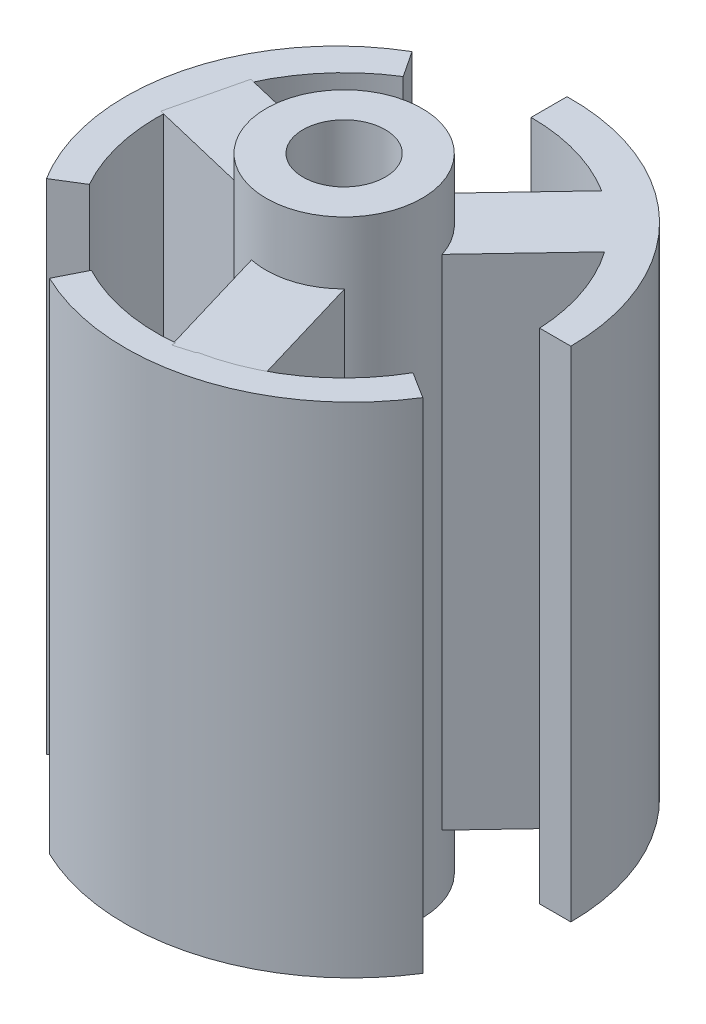
ISO-10303-21;
HEADER;
FILE_DESCRIPTION(('STEP AP214'),'2;1');
FILE_NAME('part.step','',(''),(''),'','','');
FILE_SCHEMA(('AUTOMOTIVE_DESIGN { 1 0 10303 214 1 1 1 1 }'));
ENDSEC;
DATA;
#1=APPLICATION_CONTEXT('core data for automotive mechanical design processes');
#2=APPLICATION_PROTOCOL_DEFINITION('international standard','automotive_design',2000,#1);
#3=PRODUCT_CONTEXT('',#1,'mechanical');
#4=PRODUCT('Part','Part','',(#3));
#5=PRODUCT_RELATED_PRODUCT_CATEGORY('part','',(#4));
#6=PRODUCT_DEFINITION_FORMATION('','',#4);
#7=PRODUCT_DEFINITION_CONTEXT('part definition',#1,'design');
#8=PRODUCT_DEFINITION('design','',#6,#7);
#9=PRODUCT_DEFINITION_SHAPE('','',#8);
#10=(LENGTH_UNIT() NAMED_UNIT(*) SI_UNIT(.MILLI.,.METRE.));
#11=(NAMED_UNIT(*) PLANE_ANGLE_UNIT() SI_UNIT($,.RADIAN.));
#12=(NAMED_UNIT(*) SI_UNIT($,.STERADIAN.) SOLID_ANGLE_UNIT());
#13=UNCERTAINTY_MEASURE_WITH_UNIT(LENGTH_MEASURE(1.E-05),#10,'distance_accuracy_value','');
#14=(GEOMETRIC_REPRESENTATION_CONTEXT(3) GLOBAL_UNCERTAINTY_ASSIGNED_CONTEXT((#13)) GLOBAL_UNIT_ASSIGNED_CONTEXT((#10,
#11,#12)) REPRESENTATION_CONTEXT('',''));
#15=CARTESIAN_POINT('',(0.,0.,0.));
#16=DIRECTION('',(0.,0.,1.));
#17=DIRECTION('',(1.,0.,0.));
#18=AXIS2_PLACEMENT_3D('',#15,#16,#17);
#19=CARTESIAN_POINT('',(0.,40.,-0.700234787448357));
#20=DIRECTION('',(-0.833300516288587,0.,0.552820268761172));
#21=DIRECTION('',(0.552820268761172,0.,0.833300516288587));
#22=AXIS2_PLACEMENT_3D('',#19,#20,#21);
#23=PLANE('',#22);
#24=DIRECTION('',(0.,-1.,0.));
#25=VECTOR('',#24,1.);
#26=CARTESIAN_POINT('',(-7.96696829436854,40.,-12.7093436571888));
#27=LINE('',#26,#25);
#28=CARTESIAN_POINT('',(-7.96696829436854,0.,-12.7093436571888));
#29=VERTEX_POINT('',#28);
#30=CARTESIAN_POINT('',(-7.96696829436854,40.,-12.7093436571888));
#31=VERTEX_POINT('',#30);
#32=EDGE_CURVE('E172',#29,#31,#27,.F.);
#33=ORIENTED_EDGE('',*,*,#32,.F.);
#34=DIRECTION('',(-0.552820268761172,0.,-0.833300516288587));
#35=VECTOR('',#34,1.);
#36=CARTESIAN_POINT('',(0.,0.,-0.700234787448357));
#37=LINE('',#36,#35);
#38=CARTESIAN_POINT('',(-9.34941361200224,0.,-14.793189822067));
#39=VERTEX_POINT('',#38);
#40=EDGE_CURVE('E13',#29,#39,#37,.T.);
#41=ORIENTED_EDGE('',*,*,#40,.T.);
#42=DIRECTION('',(0.,-1.,0.));
#43=VECTOR('',#42,1.);
#44=CARTESIAN_POINT('',(-9.34941361200224,40.,-14.793189822067));
#45=LINE('',#44,#43);
#46=CARTESIAN_POINT('',(-9.34941361200224,40.,-14.793189822067));
#47=VERTEX_POINT('',#46);
#48=EDGE_CURVE('E167',#47,#39,#45,.T.);
#49=ORIENTED_EDGE('',*,*,#48,.F.);
#50=DIRECTION('',(-0.552820268761172,0.,-0.833300516288587));
#51=VECTOR('',#50,1.);
#52=CARTESIAN_POINT('',(0.,40.,-0.700234787448357));
#53=LINE('',#52,#51);
#54=EDGE_CURVE('E126',#31,#47,#53,.T.);
#55=ORIENTED_EDGE('',*,*,#54,.F.);
#56=EDGE_LOOP('',(#33,#41,#49,#55));
#57=FACE_BOUND('',#56,.T.);
#58=ADVANCED_FACE('F122',(#57),#23,.F.);
#59=CARTESIAN_POINT('',(-15.1905349294899,40.,8.68893828703761));
#60=DIRECTION('',(-0.525767830062802,0.,-0.850628114319679));
#61=DIRECTION('',(-0.850628114319679,0.,0.525767830062802));
#62=AXIS2_PLACEMENT_3D('',#59,#60,#61);
#63=PLANE('',#62);
#64=DIRECTION('',(0.,-1.,0.));
#65=VECTOR('',#64,1.);
#66=CARTESIAN_POINT('',(-13.0625260727711,40.,7.37362954034011));
#67=LINE('',#66,#65);
#68=CARTESIAN_POINT('',(-13.0625260727711,40.,7.37362954034011));
#69=VERTEX_POINT('',#68);
#70=CARTESIAN_POINT('',(-13.0625260727711,0.,7.37362954034011));
#71=VERTEX_POINT('',#70);
#72=EDGE_CURVE('E139',#69,#71,#67,.T.);
#73=ORIENTED_EDGE('',*,*,#72,.F.);
#74=DIRECTION('',(0.850628114319679,0.,-0.525767830062802));
#75=VECTOR('',#74,1.);
#76=CARTESIAN_POINT('',(-15.1905349294899,40.,8.68893828703761));
#77=LINE('',#76,#75);
#78=CARTESIAN_POINT('',(-15.1905349294899,40.,8.68893828703761));
#79=VERTEX_POINT('',#78);
#80=EDGE_CURVE('E176',#79,#69,#77,.T.);
#81=ORIENTED_EDGE('',*,*,#80,.F.);
#82=DIRECTION('',(0.,-1.,0.));
#83=VECTOR('',#82,1.);
#84=CARTESIAN_POINT('',(-15.1905349294899,40.,8.68893828703761));
#85=LINE('',#84,#83);
#86=CARTESIAN_POINT('',(-15.1905349294899,0.,8.68893828703761));
#87=VERTEX_POINT('',#86);
#88=EDGE_CURVE('E171',#79,#87,#85,.T.);
#89=ORIENTED_EDGE('',*,*,#88,.T.);
#90=DIRECTION('',(0.850628114319679,0.,-0.525767830062802));
#91=VECTOR('',#90,1.);
#92=CARTESIAN_POINT('',(-15.1905349294899,0.,8.68893828703761));
#93=LINE('',#92,#91);
#94=EDGE_CURVE('E166',#87,#71,#93,.T.);
#95=ORIENTED_EDGE('',*,*,#94,.T.);
#96=EDGE_LOOP('',(#73,#81,#89,#95));
#97=FACE_BOUND('',#96,.T.);
#98=ADVANCED_FACE('F192',(#97),#63,.F.);
#99=CARTESIAN_POINT('',(-0.807800564734451,40.,-0.200938393531703));
#100=DIRECTION('',(0.,-1.,0.));
#101=DIRECTION('',(0.,0.,-1.));
#102=AXIS2_PLACEMENT_3D('',#99,#100,#101);
#103=CYLINDRICAL_SURFACE('',#102,16.9083693833216);
#104=CARTESIAN_POINT('',(-0.807800564734451,0.,-0.200938393531703));
#105=DIRECTION('',(0.,-1.,0.));
#106=DIRECTION('',(0.,0.,-1.));
#107=AXIS2_PLACEMENT_3D('',#104,#105,#106);
#108=CIRCLE('',#107,16.9083693833216);
#109=EDGE_CURVE('E131',#87,#39,#108,.T.);
#110=ORIENTED_EDGE('',*,*,#109,.F.);
#111=ORIENTED_EDGE('',*,*,#88,.F.);
#112=CARTESIAN_POINT('',(-0.807800564734451,40.,-0.200938393531703));
#113=DIRECTION('',(0.,-1.,0.));
#114=DIRECTION('',(0.,0.,-1.));
#115=AXIS2_PLACEMENT_3D('',#112,#113,#114);
#116=CIRCLE('',#115,16.9083693833216);
#117=EDGE_CURVE('E163',#79,#47,#116,.T.);
#118=ORIENTED_EDGE('',*,*,#117,.T.);
#119=ORIENTED_EDGE('',*,*,#48,.T.);
#120=EDGE_LOOP('',(#110,#111,#118,#119));
#121=FACE_BOUND('',#120,.T.);
#122=ADVANCED_FACE('F174',(#121),#103,.T.);
#123=CARTESIAN_POINT('',(-0.807800564734451,40.,-0.200938393531703));
#124=DIRECTION('',(0.,-1.,0.));
#125=DIRECTION('',(0.,0.,-1.));
#126=AXIS2_PLACEMENT_3D('',#123,#124,#125);
#127=PLANE('',#126);
#128=CARTESIAN_POINT('',(0.,40.,0.));
#129=DIRECTION('',(0.,1.,0.));
#130=DIRECTION('',(0.,0.,1.));
#131=AXIS2_PLACEMENT_3D('',#128,#129,#130);
#132=CIRCLE('',#131,15.);
#133=EDGE_CURVE('E165',#31,#69,#132,.T.);
#134=ORIENTED_EDGE('',*,*,#133,.F.);
#135=ORIENTED_EDGE('',*,*,#54,.T.);
#136=ORIENTED_EDGE('',*,*,#117,.F.);
#137=ORIENTED_EDGE('',*,*,#80,.T.);
#138=EDGE_LOOP('',(#134,#135,#136,#137));
#139=FACE_BOUND('',#138,.T.);
#140=ADVANCED_FACE('F124',(#139),#127,.F.);
#141=CARTESIAN_POINT('',(-0.807800564734451,0.,-0.200938393531703));
#142=DIRECTION('',(0.,-1.,0.));
#143=DIRECTION('',(0.,0.,-1.));
#144=AXIS2_PLACEMENT_3D('',#141,#142,#143);
#145=PLANE('',#144);
#146=ORIENTED_EDGE('',*,*,#40,.F.);
#147=CARTESIAN_POINT('',(0.,0.,0.));
#148=DIRECTION('',(0.,1.,0.));
#149=DIRECTION('',(0.,0.,1.));
#150=AXIS2_PLACEMENT_3D('',#147,#148,#149);
#151=CIRCLE('',#150,15.);
#152=EDGE_CURVE('E186',#29,#71,#151,.T.);
#153=ORIENTED_EDGE('',*,*,#152,.T.);
#154=ORIENTED_EDGE('',*,*,#94,.F.);
#155=ORIENTED_EDGE('',*,*,#109,.T.);
#156=EDGE_LOOP('',(#146,#153,#154,#155));
#157=FACE_BOUND('',#156,.T.);
#158=ADVANCED_FACE('F195',(#157),#145,.T.);
#159=CARTESIAN_POINT('',(0.,40.,0.));
#160=DIRECTION('',(0.,-1.,0.));
#161=DIRECTION('',(0.,0.,-1.));
#162=AXIS2_PLACEMENT_3D('',#159,#160,#161);
#163=CYLINDRICAL_SURFACE('',#162,15.);
#164=ORIENTED_EDGE('',*,*,#32,.T.);
#165=ORIENTED_EDGE('',*,*,#133,.T.);
#166=ORIENTED_EDGE('',*,*,#72,.T.);
#167=ORIENTED_EDGE('',*,*,#152,.F.);
#168=EDGE_LOOP('',(#164,#165,#166,#167));
#169=FACE_BOUND('',#168,.T.);
#170=ADVANCED_FACE('F189',(#169),#163,.F.);
#171=CLOSED_SHELL('',(#58,#98,#122,#140,#158,#170));
#172=MANIFOLD_SOLID_BREP('B2',#171);
#173=CARTESIAN_POINT('',(0.301930105193301,0.,-0.700234787448357));
#174=DIRECTION('',(0.,1.,0.));
#175=DIRECTION('',(0.,0.,1.));
#176=AXIS2_PLACEMENT_3D('',#173,#174,#175);
#177=PLANE('',#176);
#178=DIRECTION('',(-0.687835338297251,0.,0.725866755947334));
#179=VECTOR('',#178,1.);
#180=CARTESIAN_POINT('',(2.17760026784201,0.,2.06350601489176));
#181=LINE('',#180,#179);
#182=CARTESIAN_POINT('',(12.2866739031395,0.,-8.60451302503002));
#183=VERTEX_POINT('',#182);
#184=CARTESIAN_POINT('',(5.94895193788061,0.,-1.91636918175663));
#185=VERTEX_POINT('',#184);
#186=EDGE_CURVE('E383',#183,#185,#181,.T.);
#187=ORIENTED_EDGE('',*,*,#186,.T.);
#188=CARTESIAN_POINT('',(0.,0.,0.));
#189=DIRECTION('',(0.,1.,0.));
#190=DIRECTION('',(0.,0.,1.));
#191=AXIS2_PLACEMENT_3D('',#188,#189,#190);
#192=CIRCLE('',#191,6.25);
#193=CARTESIAN_POINT('',(1.5937514021966,0.,-6.04338121154014));
#194=VERTEX_POINT('',#193);
#195=EDGE_CURVE('E120',#185,#194,#192,.T.);
#196=ORIENTED_EDGE('',*,*,#195,.T.);
#197=DIRECTION('',(-0.68783533829725,0.,0.725866755947335));
#198=VECTOR('',#197,1.);
#199=CARTESIAN_POINT('',(-2.177600267842,0.,-2.06350601489175));
#200=LINE('',#199,#198);
#201=CARTESIAN_POINT('',(7.93147336745547,0.,-12.7315250548135));
#202=VERTEX_POINT('',#201);
#203=EDGE_CURVE('E393',#202,#194,#200,.T.);
#204=ORIENTED_EDGE('',*,*,#203,.F.);
#205=CARTESIAN_POINT('',(0.,0.,0.));
#206=DIRECTION('',(0.,1.,0.));
#207=DIRECTION('',(0.,0.,1.));
#208=AXIS2_PLACEMENT_3D('',#205,#206,#207);
#209=CIRCLE('',#208,15.);
#210=CARTESIAN_POINT('',(0.,0.,-15.));
#211=VERTEX_POINT('',#210);
#212=EDGE_CURVE('E418',#202,#211,#209,.T.);
#213=ORIENTED_EDGE('',*,*,#212,.T.);
#214=DIRECTION('',(0.,0.,-1.));
#215=VECTOR('',#214,1.);
#216=CARTESIAN_POINT('',(0.,0.,-0.700234787448357));
#217=LINE('',#216,#215);
#218=CARTESIAN_POINT('',(0.,0.,-17.8816369614445));
#219=VERTEX_POINT('',#218);
#220=EDGE_CURVE('E442',#211,#219,#217,.T.);
#221=ORIENTED_EDGE('',*,*,#220,.T.);
#222=CARTESIAN_POINT('',(0.301930105193301,0.,-0.700234787448357));
#223=DIRECTION('',(0.,1.,0.));
#224=DIRECTION('',(0.,0.,1.));
#225=AXIS2_PLACEMENT_3D('',#222,#223,#224);
#226=CIRCLE('',#225,17.1840548897233);
#227=CARTESIAN_POINT('',(17.4859849949166,0.,-0.700234787448357));
#228=VERTEX_POINT('',#227);
#229=EDGE_CURVE('E438',#228,#219,#226,.T.);
#230=ORIENTED_EDGE('',*,*,#229,.F.);
#231=DIRECTION('',(1.,0.,0.));
#232=VECTOR('',#231,1.);
#233=CARTESIAN_POINT('',(0.,0.,-0.700234787448357));
#234=LINE('',#233,#232);
#235=CARTESIAN_POINT('',(14.9836467938365,0.,-0.700234787448357));
#236=VERTEX_POINT('',#235);
#237=EDGE_CURVE('E436',#236,#228,#234,.T.);
#238=ORIENTED_EDGE('',*,*,#237,.F.);
#239=EDGE_CURVE('E392',#236,#183,#209,.T.);
#240=ORIENTED_EDGE('',*,*,#239,.T.);
#241=EDGE_LOOP('',(#187,#196,#204,#213,#221,#230,#238,#240));
#242=FACE_BOUND('',#241,.T.);
#243=ADVANCED_FACE('F254',(#242),#177,.F.);
#244=DIRECTION('',(0.972536719561615,0.,0.232749498612419));
#245=VECTOR('',#244,1.);
#246=CARTESIAN_POINT('',(0.698248495837243,0.,-2.91761015868479));
#247=LINE('',#246,#245);
#248=CARTESIAN_POINT('',(-13.889802297587,0.,-6.40885263787108));
#249=VERTEX_POINT('',#248);
#250=CARTESIAN_POINT('',(-4.63410036337118,0.,-4.19375891321892));
#251=VERTEX_POINT('',#250);
#252=EDGE_CURVE('E396',#249,#251,#247,.T.);
#253=ORIENTED_EDGE('',*,*,#252,.T.);
#254=CARTESIAN_POINT('',(-6.03059735504565,0.,1.64146140415073));
#255=VERTEX_POINT('',#254);
#256=EDGE_CURVE('E263',#251,#255,#192,.T.);
#257=ORIENTED_EDGE('',*,*,#256,.T.);
#258=DIRECTION('',(0.972536719561617,0.,0.232749498612412));
#259=VECTOR('',#258,1.);
#260=CARTESIAN_POINT('',(-0.698248495837229,0.,2.91761015868482));
#261=LINE('',#260,#259);
#262=CARTESIAN_POINT('',(-15.2862992892615,0.,-0.573632320501362));
#263=VERTEX_POINT('',#262);
#264=EDGE_CURVE('E471',#263,#255,#261,.T.);
#265=ORIENTED_EDGE('',*,*,#264,.F.);
#266=DIRECTION('',(-0.232749498612407,0.,0.972536719561618));
#267=VECTOR('',#266,1.);
#268=CARTESIAN_POINT('',(-14.5880507934243,0.,-3.4912424791861));
#269=LINE('',#268,#267);
#270=EDGE_CURVE('E404',#249,#263,#269,.T.);
#271=ORIENTED_EDGE('',*,*,#270,.F.);
#272=EDGE_LOOP('',(#253,#257,#265,#271));
#273=FACE_BOUND('',#272,.T.);
#274=ADVANCED_FACE('F501',(#273),#177,.F.);
#275=CARTESIAN_POINT('',(0.301930105193301,40.,-0.700234787448357));
#276=DIRECTION('',(0.,1.,0.));
#277=DIRECTION('',(0.,0.,1.));
#278=AXIS2_PLACEMENT_3D('',#275,#276,#277);
#279=PLANE('',#278);
#280=DIRECTION('',(0.972536719561617,0.,0.232749498612412));
#281=VECTOR('',#280,1.);
#282=CARTESIAN_POINT('',(-0.698248495837229,40.,2.91761015868482));
#283=LINE('',#282,#281);
#284=CARTESIAN_POINT('',(-15.2862992892615,40.,-0.573632320501362));
#285=VERTEX_POINT('',#284);
#286=CARTESIAN_POINT('',(-6.03059735504565,40.,1.64146140415073));
#287=VERTEX_POINT('',#286);
#288=EDGE_CURVE('E406',#285,#287,#283,.T.);
#289=ORIENTED_EDGE('',*,*,#288,.T.);
#290=CARTESIAN_POINT('',(0.,40.,0.));
#291=DIRECTION('',(0.,1.,0.));
#292=DIRECTION('',(0.,0.,1.));
#293=AXIS2_PLACEMENT_3D('',#290,#291,#292);
#294=CIRCLE('',#293,6.25);
#295=CARTESIAN_POINT('',(-4.63410036337118,40.,-4.19375891321892));
#296=VERTEX_POINT('',#295);
#297=EDGE_CURVE('E461',#287,#296,#294,.F.);
#298=ORIENTED_EDGE('',*,*,#297,.T.);
#299=DIRECTION('',(0.972536719561615,0.,0.232749498612419));
#300=VECTOR('',#299,1.);
#301=CARTESIAN_POINT('',(0.698248495837243,40.,-2.91761015868479));
#302=LINE('',#301,#300);
#303=CARTESIAN_POINT('',(-13.889802297587,40.,-6.40885263787108));
#304=VERTEX_POINT('',#303);
#305=EDGE_CURVE('E485',#304,#296,#302,.T.);
#306=ORIENTED_EDGE('',*,*,#305,.F.);
#307=DIRECTION('',(-0.232749498612407,0.,0.972536719561618));
#308=VECTOR('',#307,1.);
#309=CARTESIAN_POINT('',(-14.5880507934243,40.,-3.4912424791861));
#310=LINE('',#309,#308);
#311=EDGE_CURVE('E411',#304,#285,#310,.T.);
#312=ORIENTED_EDGE('',*,*,#311,.T.);
#313=EDGE_LOOP('',(#289,#298,#306,#312));
#314=FACE_BOUND('',#313,.T.);
#315=ADVANCED_FACE('F511',(#314),#279,.T.);
#316=DIRECTION('',(-0.68783533829725,0.,0.725866755947335));
#317=VECTOR('',#316,1.);
#318=CARTESIAN_POINT('',(-2.177600267842,40.,-2.06350601489175));
#319=LINE('',#318,#317);
#320=CARTESIAN_POINT('',(7.93147336745547,40.,-12.7315250548135));
#321=VERTEX_POINT('',#320);
#322=CARTESIAN_POINT('',(1.5937514021966,40.,-6.04338121154014));
#323=VERTEX_POINT('',#322);
#324=EDGE_CURVE('E482',#321,#323,#319,.T.);
#325=ORIENTED_EDGE('',*,*,#324,.T.);
#326=CARTESIAN_POINT('',(5.94895193788061,40.,-1.91636918175663));
#327=VERTEX_POINT('',#326);
#328=EDGE_CURVE('E388',#323,#327,#294,.F.);
#329=ORIENTED_EDGE('',*,*,#328,.T.);
#330=DIRECTION('',(-0.687835338297251,0.,0.725866755947334));
#331=VECTOR('',#330,1.);
#332=CARTESIAN_POINT('',(2.17760026784201,40.,2.06350601489176));
#333=LINE('',#332,#331);
#334=CARTESIAN_POINT('',(12.2866739031395,40.,-8.60451302503002));
#335=VERTEX_POINT('',#334);
#336=EDGE_CURVE('E386',#335,#327,#333,.T.);
#337=ORIENTED_EDGE('',*,*,#336,.F.);
#338=CARTESIAN_POINT('',(0.,40.,0.));
#339=DIRECTION('',(0.,1.,0.));
#340=DIRECTION('',(0.,0.,1.));
#341=AXIS2_PLACEMENT_3D('',#338,#339,#340);
#342=CIRCLE('',#341,15.);
#343=CARTESIAN_POINT('',(14.9836467938365,40.,-0.700234787448357));
#344=VERTEX_POINT('',#343);
#345=EDGE_CURVE('E419',#344,#335,#342,.T.);
#346=ORIENTED_EDGE('',*,*,#345,.F.);
#347=DIRECTION('',(1.,0.,0.));
#348=VECTOR('',#347,1.);
#349=CARTESIAN_POINT('',(0.,40.,-0.700234787448357));
#350=LINE('',#349,#348);
#351=CARTESIAN_POINT('',(17.4859849949166,40.,-0.700234787448357));
#352=VERTEX_POINT('',#351);
#353=EDGE_CURVE('E433',#344,#352,#350,.T.);
#354=ORIENTED_EDGE('',*,*,#353,.T.);
#355=CARTESIAN_POINT('',(0.301930105193301,40.,-0.700234787448357));
#356=DIRECTION('',(0.,1.,0.));
#357=DIRECTION('',(0.,0.,1.));
#358=AXIS2_PLACEMENT_3D('',#355,#356,#357);
#359=CIRCLE('',#358,17.1840548897233);
#360=CARTESIAN_POINT('',(0.,40.,-17.8816369614445));
#361=VERTEX_POINT('',#360);
#362=EDGE_CURVE('E446',#352,#361,#359,.T.);
#363=ORIENTED_EDGE('',*,*,#362,.T.);
#364=DIRECTION('',(0.,0.,-1.));
#365=VECTOR('',#364,1.);
#366=CARTESIAN_POINT('',(0.,40.,-0.700234787448357));
#367=LINE('',#366,#365);
#368=CARTESIAN_POINT('',(0.,40.,-15.));
#369=VERTEX_POINT('',#368);
#370=EDGE_CURVE('E439',#369,#361,#367,.T.);
#371=ORIENTED_EDGE('',*,*,#370,.F.);
#372=EDGE_CURVE('E423',#321,#369,#342,.T.);
#373=ORIENTED_EDGE('',*,*,#372,.F.);
#374=EDGE_LOOP('',(#325,#329,#337,#346,#354,#363,#371,#373));
#375=FACE_BOUND('',#374,.T.);
#376=ADVANCED_FACE('F512',(#375),#279,.T.);
#377=CARTESIAN_POINT('',(2.87584876367925,40.,-0.854104143793098));
#378=DIRECTION('',(-0.95861625455975,0.,0.284701381264366));
#379=DIRECTION('',(0.284701381264366,0.,0.95861625455975));
#380=AXIS2_PLACEMENT_3D('',#377,#378,#379);
#381=PLANE('',#380);
#382=DIRECTION('',(0.,-1.,0.));
#383=VECTOR('',#382,1.);
#384=CARTESIAN_POINT('',(4.43684595284904,45.,4.40191980738939));
#385=LINE('',#384,#383);
#386=CARTESIAN_POINT('',(4.43684595284904,40.,4.40191980738939));
#387=VERTEX_POINT('',#386);
#388=CARTESIAN_POINT('',(4.43684595284904,0.,4.40191980738939));
#389=VERTEX_POINT('',#388);
#390=EDGE_CURVE('E272',#387,#389,#385,.T.);
#391=ORIENTED_EDGE('',*,*,#390,.F.);
#392=DIRECTION('',(-0.284701381264366,0.,-0.958616254559749));
#393=VECTOR('',#392,1.);
#394=CARTESIAN_POINT('',(2.87584876367925,40.,-0.854104143793098));
#395=LINE('',#394,#393);
#396=CARTESIAN_POINT('',(7.14636948264473,40.,13.5251396746031));
#397=VERTEX_POINT('',#396);
#398=EDGE_CURVE('E479',#397,#387,#395,.T.);
#399=ORIENTED_EDGE('',*,*,#398,.F.);
#400=DIRECTION('',(0.,-1.,0.));
#401=VECTOR('',#400,1.);
#402=CARTESIAN_POINT('',(7.14636948264473,40.,13.5251396746031));
#403=LINE('',#402,#401);
#404=CARTESIAN_POINT('',(7.14636948264473,0.,13.5251396746031));
#405=VERTEX_POINT('',#404);
#406=EDGE_CURVE('E413',#397,#405,#403,.T.);
#407=ORIENTED_EDGE('',*,*,#406,.T.);
#408=DIRECTION('',(-0.284701381264366,0.,-0.958616254559749));
#409=VECTOR('',#408,1.);
#410=CARTESIAN_POINT('',(2.87584876367925,0.,-0.854104143793098));
#411=LINE('',#410,#409);
#412=EDGE_CURVE('E394',#405,#389,#411,.T.);
#413=ORIENTED_EDGE('',*,*,#412,.T.);
#414=EDGE_LOOP('',(#391,#399,#407,#413));
#415=FACE_BOUND('',#414,.T.);
#416=ADVANCED_FACE('F498',(#415),#381,.F.);
#417=CARTESIAN_POINT('',(-2.87584876367925,40.,0.854104143793097));
#418=DIRECTION('',(-0.95861625455975,0.,0.284701381264365));
#419=DIRECTION('',(0.284701381264365,0.,0.95861625455975));
#420=AXIS2_PLACEMENT_3D('',#417,#418,#419);
#421=PLANE('',#420);
#422=DIRECTION('',(-0.284701381264365,0.,-0.95861625455975));
#423=VECTOR('',#422,1.);
#424=CARTESIAN_POINT('',(-2.87584876367925,40.,0.854104143793097));
#425=LINE('',#424,#423);
#426=CARTESIAN_POINT('',(1.39467195528624,40.,15.2333479621894));
#427=VERTEX_POINT('',#426);
#428=CARTESIAN_POINT('',(-1.31485157450946,40.,6.11012809497559));
#429=VERTEX_POINT('',#428);
#430=EDGE_CURVE('E474',#427,#429,#425,.T.);
#431=ORIENTED_EDGE('',*,*,#430,.T.);
#432=DIRECTION('',(0.,-1.,0.));
#433=VECTOR('',#432,1.);
#434=CARTESIAN_POINT('',(-1.31485157450946,45.,6.11012809497559));
#435=LINE('',#434,#433);
#436=CARTESIAN_POINT('',(-1.31485157450946,0.,6.11012809497559));
#437=VERTEX_POINT('',#436);
#438=EDGE_CURVE('E387',#429,#437,#435,.T.);
#439=ORIENTED_EDGE('',*,*,#438,.T.);
#440=DIRECTION('',(-0.284701381264365,0.,-0.95861625455975));
#441=VECTOR('',#440,1.);
#442=CARTESIAN_POINT('',(-2.87584876367925,0.,0.854104143793097));
#443=LINE('',#442,#441);
#444=CARTESIAN_POINT('',(1.39467195528624,0.,15.2333479621894));
#445=VERTEX_POINT('',#444);
#446=EDGE_CURVE('E491',#445,#437,#443,.T.);
#447=ORIENTED_EDGE('',*,*,#446,.F.);
#448=DIRECTION('',(0.,-1.,0.));
#449=VECTOR('',#448,1.);
#450=CARTESIAN_POINT('',(1.39467195528624,40.,15.2333479621894));
#451=LINE('',#450,#449);
#452=EDGE_CURVE('E416',#427,#445,#451,.T.);
#453=ORIENTED_EDGE('',*,*,#452,.F.);
#454=EDGE_LOOP('',(#431,#439,#447,#453));
#455=FACE_BOUND('',#454,.T.);
#456=ADVANCED_FACE('F540',(#455),#421,.T.);
#457=CARTESIAN_POINT('',(2.17760026784201,40.,2.06350601489176));
#458=DIRECTION('',(0.725866755947334,0.,0.687835338297251));
#459=DIRECTION('',(0.687835338297251,0.,-0.725866755947334));
#460=AXIS2_PLACEMENT_3D('',#457,#458,#459);
#461=PLANE('',#460);
#462=ORIENTED_EDGE('',*,*,#336,.T.);
#463=DIRECTION('',(0.,-1.,0.));
#464=VECTOR('',#463,1.);
#465=CARTESIAN_POINT('',(5.94895193788061,45.,-1.91636918175663));
#466=LINE('',#465,#464);
#467=EDGE_CURVE('E374',#327,#185,#466,.T.);
#468=ORIENTED_EDGE('',*,*,#467,.T.);
#469=ORIENTED_EDGE('',*,*,#186,.F.);
#470=DIRECTION('',(0.,-1.,0.));
#471=VECTOR('',#470,1.);
#472=CARTESIAN_POINT('',(12.2866739031395,40.,-8.60451302503002));
#473=LINE('',#472,#471);
#474=EDGE_CURVE('E451',#183,#335,#473,.F.);
#475=ORIENTED_EDGE('',*,*,#474,.T.);
#476=EDGE_LOOP('',(#462,#468,#469,#475));
#477=FACE_BOUND('',#476,.T.);
#478=ADVANCED_FACE('F382',(#477),#461,.T.);
#479=CARTESIAN_POINT('',(-2.177600267842,40.,-2.06350601489175));
#480=DIRECTION('',(0.725866755947335,0.,0.68783533829725));
#481=DIRECTION('',(0.68783533829725,0.,-0.725866755947335));
#482=AXIS2_PLACEMENT_3D('',#479,#480,#481);
#483=PLANE('',#482);
#484=DIRECTION('',(0.,-1.,0.));
#485=VECTOR('',#484,1.);
#486=CARTESIAN_POINT('',(1.5937514021966,45.,-6.04338121154014));
#487=LINE('',#486,#485);
#488=EDGE_CURVE('E375',#323,#194,#487,.T.);
#489=ORIENTED_EDGE('',*,*,#488,.F.);
#490=ORIENTED_EDGE('',*,*,#324,.F.);
#491=DIRECTION('',(0.,-1.,0.));
#492=VECTOR('',#491,1.);
#493=CARTESIAN_POINT('',(7.93147336745547,40.,-12.7315250548135));
#494=LINE('',#493,#492);
#495=EDGE_CURVE('E444',#202,#321,#494,.F.);
#496=ORIENTED_EDGE('',*,*,#495,.F.);
#497=ORIENTED_EDGE('',*,*,#203,.T.);
#498=EDGE_LOOP('',(#489,#490,#496,#497));
#499=FACE_BOUND('',#498,.T.);
#500=ADVANCED_FACE('F548',(#499),#483,.F.);
#501=CARTESIAN_POINT('',(0.698248495837243,40.,-2.91761015868479));
#502=DIRECTION('',(0.232749498612419,0.,-0.972536719561615));
#503=DIRECTION('',(-0.972536719561615,0.,-0.232749498612419));
#504=AXIS2_PLACEMENT_3D('',#501,#502,#503);
#505=PLANE('',#504);
#506=ORIENTED_EDGE('',*,*,#305,.T.);
#507=DIRECTION('',(0.,-1.,0.));
#508=VECTOR('',#507,1.);
#509=CARTESIAN_POINT('',(-4.63410036337118,45.,-4.19375891321892));
#510=LINE('',#509,#508);
#511=EDGE_CURVE('E463',#296,#251,#510,.T.);
#512=ORIENTED_EDGE('',*,*,#511,.T.);
#513=ORIENTED_EDGE('',*,*,#252,.F.);
#514=DIRECTION('',(0.,-1.,0.));
#515=VECTOR('',#514,1.);
#516=CARTESIAN_POINT('',(-13.889802297587,40.,-6.40885263787108));
#517=LINE('',#516,#515);
#518=EDGE_CURVE('E410',#304,#249,#517,.T.);
#519=ORIENTED_EDGE('',*,*,#518,.F.);
#520=EDGE_LOOP('',(#506,#512,#513,#519));
#521=FACE_BOUND('',#520,.T.);
#522=ADVANCED_FACE('F538',(#521),#505,.T.);
#523=CARTESIAN_POINT('',(-0.698248495837229,40.,2.91761015868482));
#524=DIRECTION('',(0.232749498612412,0.,-0.972536719561617));
#525=DIRECTION('',(-0.972536719561617,0.,-0.232749498612412));
#526=AXIS2_PLACEMENT_3D('',#523,#524,#525);
#527=PLANE('',#526);
#528=DIRECTION('',(0.,-1.,0.));
#529=VECTOR('',#528,1.);
#530=CARTESIAN_POINT('',(-6.03059735504565,45.,1.64146140415073));
#531=LINE('',#530,#529);
#532=EDGE_CURVE('E258',#287,#255,#531,.T.);
#533=ORIENTED_EDGE('',*,*,#532,.F.);
#534=ORIENTED_EDGE('',*,*,#288,.F.);
#535=DIRECTION('',(0.,-1.,0.));
#536=VECTOR('',#535,1.);
#537=CARTESIAN_POINT('',(-15.2862992892615,40.,-0.573632320501362));
#538=LINE('',#537,#536);
#539=EDGE_CURVE('E407',#285,#263,#538,.T.);
#540=ORIENTED_EDGE('',*,*,#539,.T.);
#541=ORIENTED_EDGE('',*,*,#264,.T.);
#542=EDGE_LOOP('',(#533,#534,#540,#541));
#543=FACE_BOUND('',#542,.T.);
#544=ADVANCED_FACE('F534',(#543),#527,.F.);
#545=CARTESIAN_POINT('',(0.,40.,0.));
#546=DIRECTION('',(0.,-1.,0.));
#547=DIRECTION('',(0.,0.,-1.));
#548=AXIS2_PLACEMENT_3D('',#545,#546,#547);
#549=CYLINDRICAL_SURFACE('',#548,15.);
#550=ORIENTED_EDGE('',*,*,#474,.F.);
#551=ORIENTED_EDGE('',*,*,#239,.F.);
#552=DIRECTION('',(0.,-1.,0.));
#553=VECTOR('',#552,1.);
#554=CARTESIAN_POINT('',(14.9836467938365,40.,-0.700234787448357));
#555=LINE('',#554,#553);
#556=EDGE_CURVE('E422',#236,#344,#555,.F.);
#557=ORIENTED_EDGE('',*,*,#556,.T.);
#558=ORIENTED_EDGE('',*,*,#345,.T.);
#559=EDGE_LOOP('',(#550,#551,#557,#558));
#560=FACE_BOUND('',#559,.T.);
#561=ADVANCED_FACE('F531',(#560),#549,.F.);
#562=ORIENTED_EDGE('',*,*,#212,.F.);
#563=ORIENTED_EDGE('',*,*,#495,.T.);
#564=ORIENTED_EDGE('',*,*,#372,.T.);
#565=DIRECTION('',(0.,-1.,0.));
#566=VECTOR('',#565,1.);
#567=CARTESIAN_POINT('',(0.,40.,-15.));
#568=LINE('',#567,#566);
#569=EDGE_CURVE('E426',#211,#369,#568,.F.);
#570=ORIENTED_EDGE('',*,*,#569,.F.);
#571=EDGE_LOOP('',(#562,#563,#564,#570));
#572=FACE_BOUND('',#571,.T.);
#573=ADVANCED_FACE('F526',(#572),#549,.F.);
#574=CARTESIAN_POINT('',(0.,40.,-0.700234787448357));
#575=DIRECTION('',(-1.,0.,0.));
#576=DIRECTION('',(0.,0.,1.));
#577=AXIS2_PLACEMENT_3D('',#574,#575,#576);
#578=PLANE('',#577);
#579=ORIENTED_EDGE('',*,*,#220,.F.);
#580=ORIENTED_EDGE('',*,*,#569,.T.);
#581=ORIENTED_EDGE('',*,*,#370,.T.);
#582=DIRECTION('',(0.,-1.,0.));
#583=VECTOR('',#582,1.);
#584=CARTESIAN_POINT('',(0.,40.,-17.8816369614445));
#585=LINE('',#584,#583);
#586=EDGE_CURVE('E430',#361,#219,#585,.T.);
#587=ORIENTED_EDGE('',*,*,#586,.T.);
#588=EDGE_LOOP('',(#579,#580,#581,#587));
#589=FACE_BOUND('',#588,.T.);
#590=ADVANCED_FACE('F521',(#589),#578,.T.);
#591=CARTESIAN_POINT('',(0.,40.,-0.700234787448357));
#592=DIRECTION('',(0.,0.,-1.));
#593=DIRECTION('',(-1.,0.,0.));
#594=AXIS2_PLACEMENT_3D('',#591,#592,#593);
#595=PLANE('',#594);
#596=ORIENTED_EDGE('',*,*,#556,.F.);
#597=ORIENTED_EDGE('',*,*,#237,.T.);
#598=DIRECTION('',(0.,-1.,0.));
#599=VECTOR('',#598,1.);
#600=CARTESIAN_POINT('',(17.4859849949166,40.,-0.700234787448357));
#601=LINE('',#600,#599);
#602=EDGE_CURVE('E429',#352,#228,#601,.T.);
#603=ORIENTED_EDGE('',*,*,#602,.F.);
#604=ORIENTED_EDGE('',*,*,#353,.F.);
#605=EDGE_LOOP('',(#596,#597,#603,#604));
#606=FACE_BOUND('',#605,.T.);
#607=ADVANCED_FACE('F503',(#606),#595,.F.);
#608=CARTESIAN_POINT('',(0.301930105193301,40.,-0.700234787448357));
#609=DIRECTION('',(0.,-1.,0.));
#610=DIRECTION('',(0.,0.,-1.));
#611=AXIS2_PLACEMENT_3D('',#608,#609,#610);
#612=CYLINDRICAL_SURFACE('',#611,17.1840548897233);
#613=ORIENTED_EDGE('',*,*,#229,.T.);
#614=ORIENTED_EDGE('',*,*,#586,.F.);
#615=ORIENTED_EDGE('',*,*,#362,.F.);
#616=ORIENTED_EDGE('',*,*,#602,.T.);
#617=EDGE_LOOP('',(#613,#614,#615,#616));
#618=FACE_BOUND('',#617,.T.);
#619=ADVANCED_FACE('F502',(#618),#612,.T.);
#620=ORIENTED_EDGE('',*,*,#398,.T.);
#621=EDGE_CURVE('E464',#387,#429,#294,.F.);
#622=ORIENTED_EDGE('',*,*,#621,.T.);
#623=ORIENTED_EDGE('',*,*,#430,.F.);
#624=DIRECTION('',(0.958616254559747,0.,-0.284701381264373));
#625=VECTOR('',#624,1.);
#626=CARTESIAN_POINT('',(4.2705207189656,40.,14.3792438183962));
#627=LINE('',#626,#625);
#628=EDGE_CURVE('E477',#427,#397,#627,.T.);
#629=ORIENTED_EDGE('',*,*,#628,.T.);
#630=EDGE_LOOP('',(#620,#622,#623,#629));
#631=FACE_BOUND('',#630,.T.);
#632=ADVANCED_FACE('F256',(#631),#279,.T.);
#633=ORIENTED_EDGE('',*,*,#446,.T.);
#634=EDGE_CURVE('E265',#437,#389,#192,.T.);
#635=ORIENTED_EDGE('',*,*,#634,.T.);
#636=ORIENTED_EDGE('',*,*,#412,.F.);
#637=DIRECTION('',(0.958616254559747,0.,-0.284701381264373));
#638=VECTOR('',#637,1.);
#639=CARTESIAN_POINT('',(4.2705207189656,0.,14.3792438183962));
#640=LINE('',#639,#638);
#641=EDGE_CURVE('E398',#445,#405,#640,.T.);
#642=ORIENTED_EDGE('',*,*,#641,.F.);
#643=EDGE_LOOP('',(#633,#635,#636,#642));
#644=FACE_BOUND('',#643,.T.);
#645=ADVANCED_FACE('F499',(#644),#177,.F.);
#646=CARTESIAN_POINT('',(4.2705207189656,40.,14.3792438183962));
#647=DIRECTION('',(-0.284701381264373,0.,-0.958616254559747));
#648=DIRECTION('',(-0.958616254559747,0.,0.284701381264373));
#649=AXIS2_PLACEMENT_3D('',#646,#647,#648);
#650=PLANE('',#649);
#651=ORIENTED_EDGE('',*,*,#641,.T.);
#652=ORIENTED_EDGE('',*,*,#406,.F.);
#653=ORIENTED_EDGE('',*,*,#628,.F.);
#654=ORIENTED_EDGE('',*,*,#452,.T.);
#655=EDGE_LOOP('',(#651,#652,#653,#654));
#656=FACE_BOUND('',#655,.T.);
#657=ADVANCED_FACE('F495',(#656),#650,.F.);
#658=CARTESIAN_POINT('',(-14.5880507934243,40.,-3.4912424791861));
#659=DIRECTION('',(0.972536719561618,0.,0.232749498612407));
#660=DIRECTION('',(0.232749498612407,0.,-0.972536719561618));
#661=AXIS2_PLACEMENT_3D('',#658,#659,#660);
#662=PLANE('',#661);
#663=ORIENTED_EDGE('',*,*,#270,.T.);
#664=ORIENTED_EDGE('',*,*,#539,.F.);
#665=ORIENTED_EDGE('',*,*,#311,.F.);
#666=ORIENTED_EDGE('',*,*,#518,.T.);
#667=EDGE_LOOP('',(#663,#664,#665,#666));
#668=FACE_BOUND('',#667,.T.);
#669=ADVANCED_FACE('F508',(#668),#662,.F.);
#670=CARTESIAN_POINT('',(0.,45.,0.));
#671=DIRECTION('',(0.,-1.,0.));
#672=DIRECTION('',(0.,0.,-1.));
#673=AXIS2_PLACEMENT_3D('',#670,#671,#672);
#674=CYLINDRICAL_SURFACE('',#673,6.25);
#675=ORIENTED_EDGE('',*,*,#195,.F.);
#676=ORIENTED_EDGE('',*,*,#467,.F.);
#677=ORIENTED_EDGE('',*,*,#328,.F.);
#678=ORIENTED_EDGE('',*,*,#488,.T.);
#679=EDGE_LOOP('',(#675,#676,#677,#678));
#680=FACE_BOUND('',#679,.T.);
#681=ORIENTED_EDGE('',*,*,#256,.F.);
#682=ORIENTED_EDGE('',*,*,#511,.F.);
#683=ORIENTED_EDGE('',*,*,#297,.F.);
#684=ORIENTED_EDGE('',*,*,#532,.T.);
#685=EDGE_LOOP('',(#681,#682,#683,#684));
#686=FACE_BOUND('',#685,.T.);
#687=CARTESIAN_POINT('',(0.,45.,0.));
#688=DIRECTION('',(0.,1.,0.));
#689=DIRECTION('',(0.,0.,1.));
#690=AXIS2_PLACEMENT_3D('',#687,#688,#689);
#691=CIRCLE('',#690,6.25);
#692=CARTESIAN_POINT('',(0.,45.,6.25));
#693=VERTEX_POINT('',#692);
#694=EDGE_CURVE('E458',#693,#693,#691,.T.);
#695=ORIENTED_EDGE('',*,*,#694,.F.);
#696=EDGE_LOOP('',(#695));
#697=FACE_BOUND('',#696,.T.);
#698=ORIENTED_EDGE('',*,*,#621,.F.);
#699=ORIENTED_EDGE('',*,*,#390,.T.);
#700=ORIENTED_EDGE('',*,*,#634,.F.);
#701=ORIENTED_EDGE('',*,*,#438,.F.);
#702=EDGE_LOOP('',(#698,#699,#700,#701));
#703=FACE_BOUND('',#702,.T.);
#704=CARTESIAN_POINT('',(0.,-5.,0.));
#705=DIRECTION('',(0.,1.,0.));
#706=DIRECTION('',(0.,0.,1.));
#707=AXIS2_PLACEMENT_3D('',#704,#705,#706);
#708=CIRCLE('',#707,6.25);
#709=CARTESIAN_POINT('',(0.,-5.,6.25));
#710=VERTEX_POINT('',#709);
#711=EDGE_CURVE('E456',#710,#710,#708,.T.);
#712=ORIENTED_EDGE('',*,*,#711,.T.);
#713=EDGE_LOOP('',(#712));
#714=FACE_BOUND('',#713,.T.);
#715=ADVANCED_FACE('F371',(#680,#686,#697,#703,#714),#674,.T.);
#716=CARTESIAN_POINT('',(0.,45.,0.));
#717=DIRECTION('',(0.,1.,0.));
#718=DIRECTION('',(0.,0.,1.));
#719=AXIS2_PLACEMENT_3D('',#716,#717,#718);
#720=PLANE('',#719);
#721=CARTESIAN_POINT('',(0.,45.,0.));
#722=DIRECTION('',(0.,-1.,0.));
#723=DIRECTION('',(0.,0.,-1.));
#724=AXIS2_PLACEMENT_3D('',#721,#722,#723);
#725=CIRCLE('',#724,3.3);
#726=CARTESIAN_POINT('',(0.,45.,-3.3));
#727=VERTEX_POINT('',#726);
#728=EDGE_CURVE('E576',#727,#727,#725,.T.);
#729=ORIENTED_EDGE('',*,*,#728,.T.);
#730=EDGE_LOOP('',(#729));
#731=FACE_BOUND('',#730,.T.);
#732=ORIENTED_EDGE('',*,*,#694,.T.);
#733=EDGE_LOOP('',(#732));
#734=FACE_BOUND('',#733,.T.);
#735=ADVANCED_FACE('F560',(#731,#734),#720,.T.);
#736=CARTESIAN_POINT('',(0.,-5.,0.));
#737=DIRECTION('',(0.,1.,0.));
#738=DIRECTION('',(0.,0.,1.));
#739=AXIS2_PLACEMENT_3D('',#736,#737,#738);
#740=PLANE('',#739);
#741=CARTESIAN_POINT('',(0.,-5.,0.));
#742=DIRECTION('',(0.,-1.,0.));
#743=DIRECTION('',(0.,0.,-1.));
#744=AXIS2_PLACEMENT_3D('',#741,#742,#743);
#745=CIRCLE('',#744,3.3);
#746=CARTESIAN_POINT('',(0.,-5.,-3.3));
#747=VERTEX_POINT('',#746);
#748=EDGE_CURVE('E579',#747,#747,#745,.T.);
#749=ORIENTED_EDGE('',*,*,#748,.F.);
#750=EDGE_LOOP('',(#749));
#751=FACE_BOUND('',#750,.T.);
#752=ORIENTED_EDGE('',*,*,#711,.F.);
#753=EDGE_LOOP('',(#752));
#754=FACE_BOUND('',#753,.T.);
#755=ADVANCED_FACE('F563',(#751,#754),#740,.F.);
#756=CARTESIAN_POINT('',(0.,45.,0.));
#757=DIRECTION('',(0.,-1.,0.));
#758=DIRECTION('',(0.,0.,-1.));
#759=AXIS2_PLACEMENT_3D('',#756,#757,#758);
#760=CYLINDRICAL_SURFACE('',#759,3.3);
#761=ORIENTED_EDGE('',*,*,#728,.F.);
#762=EDGE_LOOP('',(#761));
#763=FACE_BOUND('',#762,.T.);
#764=ORIENTED_EDGE('',*,*,#748,.T.);
#765=EDGE_LOOP('',(#764));
#766=FACE_BOUND('',#765,.T.);
#767=ADVANCED_FACE('F567',(#763,#766),#760,.F.);
#768=CLOSED_SHELL('',(#243,#274,#315,#376,#416,#456,#478,#500,#522,#544,#561,#573,#590,#607,
#619,#632,#645,#657,#669,#715,#735,#755,#767));
#769=MANIFOLD_SOLID_BREP('B7',#768);
#770=CARTESIAN_POINT('',(0.,40.,-0.700234787448357));
#771=DIRECTION('',(0.893548309572567,0.,0.448967057210224));
#772=DIRECTION('',(0.448967057210224,0.,-0.893548309572567));
#773=AXIS2_PLACEMENT_3D('',#770,#771,#772);
#774=PLANE('',#773);
#775=DIRECTION('',(0.,-1.,0.));
#776=VECTOR('',#775,1.);
#777=CARTESIAN_POINT('',(-7.01394237388629,40.,13.2591331683411));
#778=LINE('',#777,#776);
#779=CARTESIAN_POINT('',(-7.01394237388628,0.,13.2591331683411));
#780=VERTEX_POINT('',#779);
#781=CARTESIAN_POINT('',(-7.01394237388628,40.,13.2591331683411));
#782=VERTEX_POINT('',#781);
#783=EDGE_CURVE('E951',#780,#782,#778,.F.);
#784=ORIENTED_EDGE('',*,*,#783,.F.);
#785=DIRECTION('',(-0.448967057210224,0.,0.893548309572567));
#786=VECTOR('',#785,1.);
#787=CARTESIAN_POINT('',(0.,0.,-0.700234787448357));
#788=LINE('',#787,#786);
#789=CARTESIAN_POINT('',(-8.13657138291427,0.,15.4934246095155));
#790=VERTEX_POINT('',#789);
#791=EDGE_CURVE('E949',#780,#790,#788,.T.);
#792=ORIENTED_EDGE('',*,*,#791,.T.);
#793=DIRECTION('',(0.,-1.,0.));
#794=VECTOR('',#793,1.);
#795=CARTESIAN_POINT('',(-8.13657138291427,40.,15.4934246095155));
#796=LINE('',#795,#794);
#797=CARTESIAN_POINT('',(-8.13657138291427,40.,15.4934246095155));
#798=VERTEX_POINT('',#797);
#799=EDGE_CURVE('E905',#798,#790,#796,.T.);
#800=ORIENTED_EDGE('',*,*,#799,.F.);
#801=DIRECTION('',(-0.448967057210224,0.,0.893548309572567));
#802=VECTOR('',#801,1.);
#803=CARTESIAN_POINT('',(0.,40.,-0.700234787448357));
#804=LINE('',#803,#802);
#805=EDGE_CURVE('E944',#782,#798,#804,.T.);
#806=ORIENTED_EDGE('',*,*,#805,.F.);
#807=EDGE_LOOP('',(#784,#792,#800,#806));
#808=FACE_BOUND('',#807,.T.);
#809=ADVANCED_FACE('F898',(#808),#774,.F.);
#810=CARTESIAN_POINT('',(15.1201087532347,40.,8.81092000249443));
#811=DIRECTION('',(-0.532455877456418,0.,0.846457759467131));
#812=DIRECTION('',(0.846457759467131,0.,0.532455877456418));
#813=AXIS2_PLACEMENT_3D('',#810,#811,#812);
#814=PLANE('',#813);
#815=DIRECTION('',(0.,-1.,0.));
#816=VECTOR('',#815,1.);
#817=CARTESIAN_POINT('',(13.0025468528129,40.,7.47888864340194));
#818=LINE('',#817,#816);
#819=CARTESIAN_POINT('',(13.0025468528129,40.,7.47888864340194));
#820=VERTEX_POINT('',#819);
#821=CARTESIAN_POINT('',(13.0025468528129,0.,7.47888864340194));
#822=VERTEX_POINT('',#821);
#823=EDGE_CURVE('E912',#820,#822,#818,.T.);
#824=ORIENTED_EDGE('',*,*,#823,.F.);
#825=DIRECTION('',(-0.846457759467131,0.,-0.532455877456418));
#826=VECTOR('',#825,1.);
#827=CARTESIAN_POINT('',(15.1201087532347,40.,8.81092000249443));
#828=LINE('',#827,#826);
#829=CARTESIAN_POINT('',(15.1201087532347,40.,8.81092000249443));
#830=VERTEX_POINT('',#829);
#831=EDGE_CURVE('E936',#830,#820,#828,.T.);
#832=ORIENTED_EDGE('',*,*,#831,.F.);
#833=DIRECTION('',(0.,-1.,0.));
#834=VECTOR('',#833,1.);
#835=CARTESIAN_POINT('',(15.1201087532347,40.,8.81092000249443));
#836=LINE('',#835,#834);
#837=CARTESIAN_POINT('',(15.1201087532347,0.,8.81092000249443));
#838=VERTEX_POINT('',#837);
#839=EDGE_CURVE('E920',#830,#838,#836,.T.);
#840=ORIENTED_EDGE('',*,*,#839,.T.);
#841=DIRECTION('',(-0.846457759467131,0.,-0.532455877456418));
#842=VECTOR('',#841,1.);
#843=CARTESIAN_POINT('',(15.1201087532347,0.,8.81092000249443));
#844=LINE('',#843,#842);
#845=EDGE_CURVE('E934',#838,#822,#844,.T.);
#846=ORIENTED_EDGE('',*,*,#845,.T.);
#847=EDGE_LOOP('',(#824,#832,#840,#846));
#848=FACE_BOUND('',#847,.T.);
#849=ADVANCED_FACE('F933',(#848),#814,.F.);
#850=CARTESIAN_POINT('',(-0.245593529761601,40.,-0.854722967070166));
#851=DIRECTION('',(0.,-1.,0.));
#852=DIRECTION('',(0.,0.,-1.));
#853=AXIS2_PLACEMENT_3D('',#850,#851,#852);
#854=CYLINDRICAL_SURFACE('',#853,18.152946335644);
#855=CARTESIAN_POINT('',(-0.245593529761601,0.,-0.854722967070166));
#856=DIRECTION('',(0.,-1.,0.));
#857=DIRECTION('',(0.,0.,-1.));
#858=AXIS2_PLACEMENT_3D('',#855,#856,#857);
#859=CIRCLE('',#858,18.152946335644);
#860=EDGE_CURVE('E943',#838,#790,#859,.T.);
#861=ORIENTED_EDGE('',*,*,#860,.F.);
#862=ORIENTED_EDGE('',*,*,#839,.F.);
#863=CARTESIAN_POINT('',(-0.245593529761601,40.,-0.854722967070166));
#864=DIRECTION('',(0.,-1.,0.));
#865=DIRECTION('',(0.,0.,-1.));
#866=AXIS2_PLACEMENT_3D('',#863,#864,#865);
#867=CIRCLE('',#866,18.152946335644);
#868=EDGE_CURVE('E955',#830,#798,#867,.T.);
#869=ORIENTED_EDGE('',*,*,#868,.T.);
#870=ORIENTED_EDGE('',*,*,#799,.T.);
#871=EDGE_LOOP('',(#861,#862,#869,#870));
#872=FACE_BOUND('',#871,.T.);
#873=ADVANCED_FACE('F947',(#872),#854,.T.);
#874=CARTESIAN_POINT('',(-0.245593529761601,40.,-0.854722967070166));
#875=DIRECTION('',(0.,-1.,0.));
#876=DIRECTION('',(0.,0.,-1.));
#877=AXIS2_PLACEMENT_3D('',#874,#875,#876);
#878=PLANE('',#877);
#879=CARTESIAN_POINT('',(0.,40.,0.));
#880=DIRECTION('',(0.,1.,0.));
#881=DIRECTION('',(0.,0.,1.));
#882=AXIS2_PLACEMENT_3D('',#879,#880,#881);
#883=CIRCLE('',#882,15.);
#884=EDGE_CURVE('E961',#782,#820,#883,.T.);
#885=ORIENTED_EDGE('',*,*,#884,.F.);
#886=ORIENTED_EDGE('',*,*,#805,.T.);
#887=ORIENTED_EDGE('',*,*,#868,.F.);
#888=ORIENTED_EDGE('',*,*,#831,.T.);
#889=EDGE_LOOP('',(#885,#886,#887,#888));
#890=FACE_BOUND('',#889,.T.);
#891=ADVANCED_FACE('F970',(#890),#878,.F.);
#892=CARTESIAN_POINT('',(-0.245593529761601,0.,-0.854722967070166));
#893=DIRECTION('',(0.,-1.,0.));
#894=DIRECTION('',(0.,0.,-1.));
#895=AXIS2_PLACEMENT_3D('',#892,#893,#894);
#896=PLANE('',#895);
#897=ORIENTED_EDGE('',*,*,#791,.F.);
#898=CARTESIAN_POINT('',(0.,0.,0.));
#899=DIRECTION('',(0.,-1.,0.));
#900=DIRECTION('',(0.,0.,-1.));
#901=AXIS2_PLACEMENT_3D('',#898,#899,#900);
#902=CIRCLE('',#901,15.);
#903=EDGE_CURVE('E252',#780,#822,#902,.F.);
#904=ORIENTED_EDGE('',*,*,#903,.T.);
#905=ORIENTED_EDGE('',*,*,#845,.F.);
#906=ORIENTED_EDGE('',*,*,#860,.T.);
#907=EDGE_LOOP('',(#897,#904,#905,#906));
#908=FACE_BOUND('',#907,.T.);
#909=ADVANCED_FACE('F942',(#908),#896,.T.);
#910=CARTESIAN_POINT('',(0.,40.,0.));
#911=DIRECTION('',(0.,-1.,0.));
#912=DIRECTION('',(0.,0.,-1.));
#913=AXIS2_PLACEMENT_3D('',#910,#911,#912);
#914=CYLINDRICAL_SURFACE('',#913,15.);
#915=ORIENTED_EDGE('',*,*,#783,.T.);
#916=ORIENTED_EDGE('',*,*,#884,.T.);
#917=ORIENTED_EDGE('',*,*,#823,.T.);
#918=ORIENTED_EDGE('',*,*,#903,.F.);
#919=EDGE_LOOP('',(#915,#916,#917,#918));
#920=FACE_BOUND('',#919,.T.);
#921=ADVANCED_FACE('F964',(#920),#914,.F.);
#922=CLOSED_SHELL('',(#809,#849,#873,#891,#909,#921));
#923=MANIFOLD_SOLID_BREP('B114',#922);
#924=ADVANCED_BREP_SHAPE_REPRESENTATION('',(#18,#172,#769,#923),#14);
#925=SHAPE_DEFINITION_REPRESENTATION(#9,#924);
ENDSEC;
END-ISO-10303-21;
